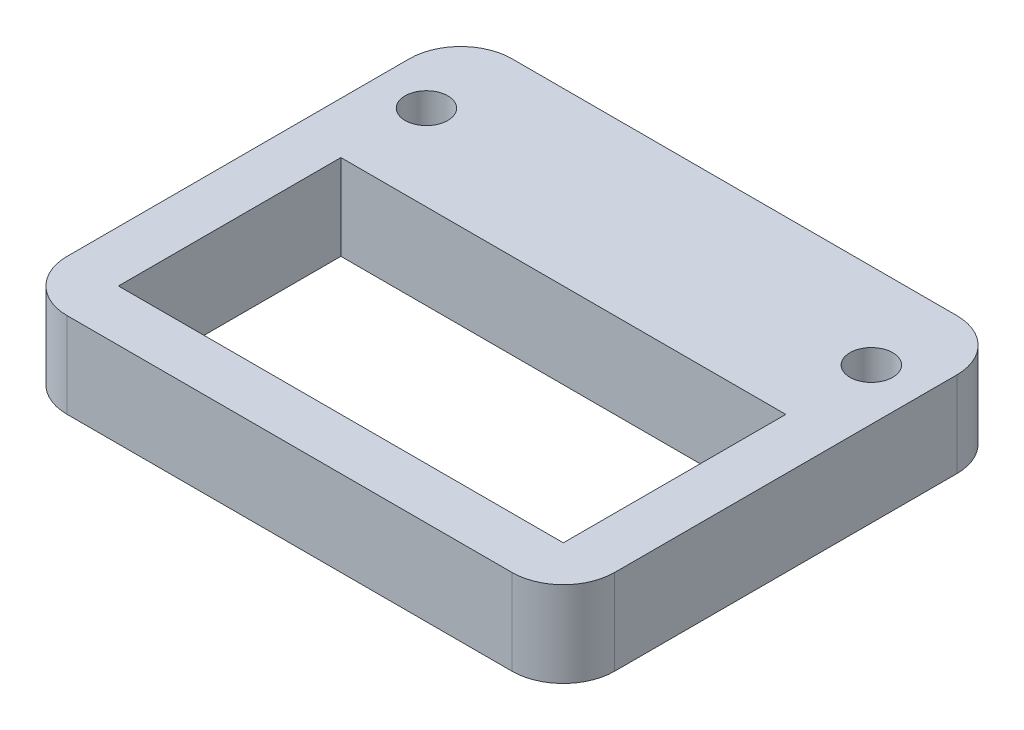
ISO-10303-21;
HEADER;
FILE_DESCRIPTION(('STEP AP214'),'2;1');
FILE_NAME('part.step','',(''),(''),'','','');
FILE_SCHEMA(('AUTOMOTIVE_DESIGN { 1 0 10303 214 1 1 1 1 }'));
ENDSEC;
DATA;
#1=APPLICATION_CONTEXT('core data for automotive mechanical design processes');
#2=APPLICATION_PROTOCOL_DEFINITION('international standard','automotive_design',2000,#1);
#3=PRODUCT_CONTEXT('',#1,'mechanical');
#4=PRODUCT('Part','Part','',(#3));
#5=PRODUCT_RELATED_PRODUCT_CATEGORY('part','',(#4));
#6=PRODUCT_DEFINITION_FORMATION('','',#4);
#7=PRODUCT_DEFINITION_CONTEXT('part definition',#1,'design');
#8=PRODUCT_DEFINITION('design','',#6,#7);
#9=PRODUCT_DEFINITION_SHAPE('','',#8);
#10=(LENGTH_UNIT() NAMED_UNIT(*) SI_UNIT(.MILLI.,.METRE.));
#11=(NAMED_UNIT(*) PLANE_ANGLE_UNIT() SI_UNIT($,.RADIAN.));
#12=(NAMED_UNIT(*) SI_UNIT($,.STERADIAN.) SOLID_ANGLE_UNIT());
#13=UNCERTAINTY_MEASURE_WITH_UNIT(LENGTH_MEASURE(1.E-05),#10,'distance_accuracy_value','');
#14=(GEOMETRIC_REPRESENTATION_CONTEXT(3) GLOBAL_UNCERTAINTY_ASSIGNED_CONTEXT((#13)) GLOBAL_UNIT_ASSIGNED_CONTEXT((#10,
#11,#12)) REPRESENTATION_CONTEXT('',''));
#15=CARTESIAN_POINT('',(0.,0.,0.));
#16=DIRECTION('',(0.,0.,1.));
#17=DIRECTION('',(1.,0.,0.));
#18=AXIS2_PLACEMENT_3D('',#15,#16,#17);
#19=CARTESIAN_POINT('',(0.,5.,0.));
#20=DIRECTION('',(0.,-1.,0.));
#21=DIRECTION('',(0.,0.,-1.));
#22=AXIS2_PLACEMENT_3D('',#19,#20,#21);
#23=PLANE('',#22);
#24=CARTESIAN_POINT('',(29.,5.,-21.));
#25=DIRECTION('',(0.,1.,0.));
#26=DIRECTION('',(0.,0.,1.));
#27=AXIS2_PLACEMENT_3D('',#24,#25,#26);
#28=CIRCLE('',#27,1.25);
#29=CARTESIAN_POINT('',(29.,5.,-19.75));
#30=VERTEX_POINT('',#29);
#31=EDGE_CURVE('E168',#30,#30,#28,.T.);
#32=ORIENTED_EDGE('',*,*,#31,.F.);
#33=EDGE_LOOP('',(#32));
#34=FACE_BOUND('',#33,.T.);
#35=DIRECTION('',(-1.,0.,0.));
#36=VECTOR('',#35,1.);
#37=CARTESIAN_POINT('',(0.,5.,-26.));
#38=LINE('',#37,#36);
#39=CARTESIAN_POINT('',(29.,5.,-26.));
#40=VERTEX_POINT('',#39);
#41=CARTESIAN_POINT('',(3.,5.,-26.));
#42=VERTEX_POINT('',#41);
#43=EDGE_CURVE('E188',#40,#42,#38,.T.);
#44=ORIENTED_EDGE('',*,*,#43,.T.);
#45=CARTESIAN_POINT('',(3.,5.,-23.));
#46=DIRECTION('',(0.,-1.,0.));
#47=DIRECTION('',(0.,0.,-1.));
#48=AXIS2_PLACEMENT_3D('',#45,#46,#47);
#49=CIRCLE('',#48,3.);
#50=CARTESIAN_POINT('',(0.,5.,-23.));
#51=VERTEX_POINT('',#50);
#52=EDGE_CURVE('E223',#42,#51,#49,.F.);
#53=ORIENTED_EDGE('',*,*,#52,.T.);
#54=DIRECTION('',(0.,0.,1.));
#55=VECTOR('',#54,1.);
#56=CARTESIAN_POINT('',(0.,5.,0.));
#57=LINE('',#56,#55);
#58=CARTESIAN_POINT('',(0.,5.,-3.));
#59=VERTEX_POINT('',#58);
#60=EDGE_CURVE('E180',#51,#59,#57,.T.);
#61=ORIENTED_EDGE('',*,*,#60,.T.);
#62=CARTESIAN_POINT('',(3.,5.,-3.));
#63=DIRECTION('',(0.,-1.,0.));
#64=DIRECTION('',(0.,0.,-1.));
#65=AXIS2_PLACEMENT_3D('',#62,#63,#64);
#66=CIRCLE('',#65,3.);
#67=CARTESIAN_POINT('',(3.,5.,0.));
#68=VERTEX_POINT('',#67);
#69=EDGE_CURVE('E219',#59,#68,#66,.F.);
#70=ORIENTED_EDGE('',*,*,#69,.T.);
#71=DIRECTION('',(1.,0.,0.));
#72=VECTOR('',#71,1.);
#73=CARTESIAN_POINT('',(0.,5.,0.));
#74=LINE('',#73,#72);
#75=CARTESIAN_POINT('',(29.,5.,0.));
#76=VERTEX_POINT('',#75);
#77=EDGE_CURVE('E183',#68,#76,#74,.T.);
#78=ORIENTED_EDGE('',*,*,#77,.T.);
#79=CARTESIAN_POINT('',(29.,5.,-3.));
#80=DIRECTION('',(0.,-1.,0.));
#81=DIRECTION('',(0.,0.,-1.));
#82=AXIS2_PLACEMENT_3D('',#79,#80,#81);
#83=CIRCLE('',#82,3.);
#84=CARTESIAN_POINT('',(32.,5.,-3.));
#85=VERTEX_POINT('',#84);
#86=EDGE_CURVE('E57',#76,#85,#83,.F.);
#87=ORIENTED_EDGE('',*,*,#86,.T.);
#88=DIRECTION('',(0.,0.,-1.));
#89=VECTOR('',#88,1.);
#90=CARTESIAN_POINT('',(32.,5.,0.));
#91=LINE('',#90,#89);
#92=CARTESIAN_POINT('',(32.,5.,-23.));
#93=VERTEX_POINT('',#92);
#94=EDGE_CURVE('E186',#85,#93,#91,.T.);
#95=ORIENTED_EDGE('',*,*,#94,.T.);
#96=CARTESIAN_POINT('',(29.,5.,-23.));
#97=DIRECTION('',(0.,-1.,0.));
#98=DIRECTION('',(0.,0.,-1.));
#99=AXIS2_PLACEMENT_3D('',#96,#97,#98);
#100=CIRCLE('',#99,3.);
#101=EDGE_CURVE('E221',#93,#40,#100,.F.);
#102=ORIENTED_EDGE('',*,*,#101,.T.);
#103=EDGE_LOOP('',(#44,#53,#61,#70,#78,#87,#95,#102));
#104=FACE_BOUND('',#103,.T.);
#105=CARTESIAN_POINT('',(3.,5.,-21.));
#106=DIRECTION('',(0.,1.,0.));
#107=DIRECTION('',(0.,0.,1.));
#108=AXIS2_PLACEMENT_3D('',#105,#106,#107);
#109=CIRCLE('',#108,1.25);
#110=CARTESIAN_POINT('',(3.,5.,-19.75));
#111=VERTEX_POINT('',#110);
#112=EDGE_CURVE('E174',#111,#111,#109,.T.);
#113=ORIENTED_EDGE('',*,*,#112,.F.);
#114=EDGE_LOOP('',(#113));
#115=FACE_BOUND('',#114,.T.);
#116=DIRECTION('',(0.,0.,1.));
#117=VECTOR('',#116,1.);
#118=CARTESIAN_POINT('',(3.,5.,-3.));
#119=LINE('',#118,#117);
#120=CARTESIAN_POINT('',(3.,5.,-16.));
#121=VERTEX_POINT('',#120);
#122=CARTESIAN_POINT('',(3.,5.,-3.));
#123=VERTEX_POINT('',#122);
#124=EDGE_CURVE('E127',#121,#123,#119,.T.);
#125=ORIENTED_EDGE('',*,*,#124,.F.);
#126=DIRECTION('',(-1.,0.,0.));
#127=VECTOR('',#126,1.);
#128=CARTESIAN_POINT('',(3.,5.,-16.));
#129=LINE('',#128,#127);
#130=CARTESIAN_POINT('',(29.,5.,-16.));
#131=VERTEX_POINT('',#130);
#132=EDGE_CURVE('E152',#131,#121,#129,.T.);
#133=ORIENTED_EDGE('',*,*,#132,.F.);
#134=DIRECTION('',(0.,0.,-1.));
#135=VECTOR('',#134,1.);
#136=CARTESIAN_POINT('',(29.,5.,-3.));
#137=LINE('',#136,#135);
#138=CARTESIAN_POINT('',(29.,5.,-3.));
#139=VERTEX_POINT('',#138);
#140=EDGE_CURVE('E150',#139,#131,#137,.T.);
#141=ORIENTED_EDGE('',*,*,#140,.F.);
#142=DIRECTION('',(1.,0.,0.));
#143=VECTOR('',#142,1.);
#144=CARTESIAN_POINT('',(3.,5.,-3.));
#145=LINE('',#144,#143);
#146=EDGE_CURVE('E137',#123,#139,#145,.T.);
#147=ORIENTED_EDGE('',*,*,#146,.F.);
#148=EDGE_LOOP('',(#125,#133,#141,#147));
#149=FACE_BOUND('',#148,.T.);
#150=ADVANCED_FACE('F35',(#34,#104,#115,#149),#23,.F.);
#151=CARTESIAN_POINT('',(0.,0.,0.));
#152=DIRECTION('',(0.,-1.,0.));
#153=DIRECTION('',(0.,0.,-1.));
#154=AXIS2_PLACEMENT_3D('',#151,#152,#153);
#155=PLANE('',#154);
#156=CARTESIAN_POINT('',(29.,0.,-21.));
#157=DIRECTION('',(0.,1.,0.));
#158=DIRECTION('',(0.,0.,1.));
#159=AXIS2_PLACEMENT_3D('',#156,#157,#158);
#160=CIRCLE('',#159,1.25);
#161=CARTESIAN_POINT('',(29.,0.,-19.75));
#162=VERTEX_POINT('',#161);
#163=EDGE_CURVE('E145',#162,#162,#160,.T.);
#164=ORIENTED_EDGE('',*,*,#163,.T.);
#165=EDGE_LOOP('',(#164));
#166=FACE_BOUND('',#165,.T.);
#167=DIRECTION('',(0.,0.,1.));
#168=VECTOR('',#167,1.);
#169=CARTESIAN_POINT('',(0.,0.,0.));
#170=LINE('',#169,#168);
#171=CARTESIAN_POINT('',(0.,0.,-23.));
#172=VERTEX_POINT('',#171);
#173=CARTESIAN_POINT('',(0.,0.,-3.));
#174=VERTEX_POINT('',#173);
#175=EDGE_CURVE('E177',#172,#174,#170,.T.);
#176=ORIENTED_EDGE('',*,*,#175,.F.);
#177=CARTESIAN_POINT('',(3.,0.,-23.));
#178=DIRECTION('',(0.,-1.,0.));
#179=DIRECTION('',(0.,0.,-1.));
#180=AXIS2_PLACEMENT_3D('',#177,#178,#179);
#181=CIRCLE('',#180,3.);
#182=CARTESIAN_POINT('',(3.,0.,-26.));
#183=VERTEX_POINT('',#182);
#184=EDGE_CURVE('E211',#172,#183,#181,.T.);
#185=ORIENTED_EDGE('',*,*,#184,.T.);
#186=DIRECTION('',(-1.,0.,0.));
#187=VECTOR('',#186,1.);
#188=CARTESIAN_POINT('',(0.,0.,-26.));
#189=LINE('',#188,#187);
#190=CARTESIAN_POINT('',(29.,0.,-26.));
#191=VERTEX_POINT('',#190);
#192=EDGE_CURVE('E184',#191,#183,#189,.T.);
#193=ORIENTED_EDGE('',*,*,#192,.F.);
#194=CARTESIAN_POINT('',(29.,0.,-23.));
#195=DIRECTION('',(0.,-1.,0.));
#196=DIRECTION('',(0.,0.,-1.));
#197=AXIS2_PLACEMENT_3D('',#194,#195,#196);
#198=CIRCLE('',#197,3.);
#199=CARTESIAN_POINT('',(32.,0.,-23.));
#200=VERTEX_POINT('',#199);
#201=EDGE_CURVE('E209',#191,#200,#198,.T.);
#202=ORIENTED_EDGE('',*,*,#201,.T.);
#203=DIRECTION('',(0.,0.,-1.));
#204=VECTOR('',#203,1.);
#205=CARTESIAN_POINT('',(32.,0.,0.));
#206=LINE('',#205,#204);
#207=CARTESIAN_POINT('',(32.,0.,-3.));
#208=VERTEX_POINT('',#207);
#209=EDGE_CURVE('E197',#208,#200,#206,.T.);
#210=ORIENTED_EDGE('',*,*,#209,.F.);
#211=CARTESIAN_POINT('',(29.,0.,-3.));
#212=DIRECTION('',(0.,-1.,0.));
#213=DIRECTION('',(0.,0.,-1.));
#214=AXIS2_PLACEMENT_3D('',#211,#212,#213);
#215=CIRCLE('',#214,3.);
#216=CARTESIAN_POINT('',(29.,0.,0.));
#217=VERTEX_POINT('',#216);
#218=EDGE_CURVE('E205',#208,#217,#215,.T.);
#219=ORIENTED_EDGE('',*,*,#218,.T.);
#220=DIRECTION('',(1.,0.,0.));
#221=VECTOR('',#220,1.);
#222=CARTESIAN_POINT('',(0.,0.,0.));
#223=LINE('',#222,#221);
#224=CARTESIAN_POINT('',(3.,0.,0.));
#225=VERTEX_POINT('',#224);
#226=EDGE_CURVE('E194',#225,#217,#223,.T.);
#227=ORIENTED_EDGE('',*,*,#226,.F.);
#228=CARTESIAN_POINT('',(3.,0.,-3.));
#229=DIRECTION('',(0.,-1.,0.));
#230=DIRECTION('',(0.,0.,-1.));
#231=AXIS2_PLACEMENT_3D('',#228,#229,#230);
#232=CIRCLE('',#231,3.);
#233=EDGE_CURVE('E207',#225,#174,#232,.T.);
#234=ORIENTED_EDGE('',*,*,#233,.T.);
#235=EDGE_LOOP('',(#176,#185,#193,#202,#210,#219,#227,#234));
#236=FACE_BOUND('',#235,.T.);
#237=CARTESIAN_POINT('',(3.,0.,-21.));
#238=DIRECTION('',(0.,1.,0.));
#239=DIRECTION('',(0.,0.,1.));
#240=AXIS2_PLACEMENT_3D('',#237,#238,#239);
#241=CIRCLE('',#240,1.25);
#242=CARTESIAN_POINT('',(3.,0.,-19.75));
#243=VERTEX_POINT('',#242);
#244=EDGE_CURVE('E171',#243,#243,#241,.T.);
#245=ORIENTED_EDGE('',*,*,#244,.T.);
#246=EDGE_LOOP('',(#245));
#247=FACE_BOUND('',#246,.T.);
#248=DIRECTION('',(-1.,0.,0.));
#249=VECTOR('',#248,1.);
#250=CARTESIAN_POINT('',(3.,0.,-16.));
#251=LINE('',#250,#249);
#252=CARTESIAN_POINT('',(29.,0.,-16.));
#253=VERTEX_POINT('',#252);
#254=CARTESIAN_POINT('',(3.,0.,-16.));
#255=VERTEX_POINT('',#254);
#256=EDGE_CURVE('E138',#253,#255,#251,.T.);
#257=ORIENTED_EDGE('',*,*,#256,.T.);
#258=DIRECTION('',(0.,0.,1.));
#259=VECTOR('',#258,1.);
#260=CARTESIAN_POINT('',(3.,0.,-3.));
#261=LINE('',#260,#259);
#262=CARTESIAN_POINT('',(3.,0.,-3.));
#263=VERTEX_POINT('',#262);
#264=EDGE_CURVE('E156',#255,#263,#261,.T.);
#265=ORIENTED_EDGE('',*,*,#264,.T.);
#266=DIRECTION('',(1.,0.,0.));
#267=VECTOR('',#266,1.);
#268=CARTESIAN_POINT('',(3.,0.,-3.));
#269=LINE('',#268,#267);
#270=CARTESIAN_POINT('',(29.,0.,-3.));
#271=VERTEX_POINT('',#270);
#272=EDGE_CURVE('E144',#263,#271,#269,.T.);
#273=ORIENTED_EDGE('',*,*,#272,.T.);
#274=DIRECTION('',(0.,0.,-1.));
#275=VECTOR('',#274,1.);
#276=CARTESIAN_POINT('',(29.,0.,-3.));
#277=LINE('',#276,#275);
#278=EDGE_CURVE('E159',#271,#253,#277,.T.);
#279=ORIENTED_EDGE('',*,*,#278,.T.);
#280=EDGE_LOOP('',(#257,#265,#273,#279));
#281=FACE_BOUND('',#280,.T.);
#282=ADVANCED_FACE('F242',(#166,#236,#247,#281),#155,.T.);
#283=CARTESIAN_POINT('',(0.,5.,0.));
#284=DIRECTION('',(1.,0.,0.));
#285=DIRECTION('',(0.,0.,-1.));
#286=AXIS2_PLACEMENT_3D('',#283,#284,#285);
#287=PLANE('',#286);
#288=ORIENTED_EDGE('',*,*,#60,.F.);
#289=DIRECTION('',(0.,-1.,0.));
#290=VECTOR('',#289,1.);
#291=CARTESIAN_POINT('',(0.,5.,-23.));
#292=LINE('',#291,#290);
#293=EDGE_CURVE('E202',#51,#172,#292,.T.);
#294=ORIENTED_EDGE('',*,*,#293,.T.);
#295=ORIENTED_EDGE('',*,*,#175,.T.);
#296=DIRECTION('',(0.,-1.,0.));
#297=VECTOR('',#296,1.);
#298=CARTESIAN_POINT('',(0.,5.,-3.));
#299=LINE('',#298,#297);
#300=EDGE_CURVE('E191',#174,#59,#299,.F.);
#301=ORIENTED_EDGE('',*,*,#300,.T.);
#302=EDGE_LOOP('',(#288,#294,#295,#301));
#303=FACE_BOUND('',#302,.T.);
#304=ADVANCED_FACE('F259',(#303),#287,.F.);
#305=CARTESIAN_POINT('',(0.,5.,0.));
#306=DIRECTION('',(0.,0.,-1.));
#307=DIRECTION('',(-1.,0.,0.));
#308=AXIS2_PLACEMENT_3D('',#305,#306,#307);
#309=PLANE('',#308);
#310=ORIENTED_EDGE('',*,*,#77,.F.);
#311=DIRECTION('',(0.,-1.,0.));
#312=VECTOR('',#311,1.);
#313=CARTESIAN_POINT('',(3.,5.,0.));
#314=LINE('',#313,#312);
#315=EDGE_CURVE('E11',#68,#225,#314,.T.);
#316=ORIENTED_EDGE('',*,*,#315,.T.);
#317=ORIENTED_EDGE('',*,*,#226,.T.);
#318=DIRECTION('',(0.,-1.,0.));
#319=VECTOR('',#318,1.);
#320=CARTESIAN_POINT('',(29.,5.,0.));
#321=LINE('',#320,#319);
#322=EDGE_CURVE('E43',#217,#76,#321,.F.);
#323=ORIENTED_EDGE('',*,*,#322,.T.);
#324=EDGE_LOOP('',(#310,#316,#317,#323));
#325=FACE_BOUND('',#324,.T.);
#326=ADVANCED_FACE('F231',(#325),#309,.F.);
#327=CARTESIAN_POINT('',(32.,5.,0.));
#328=DIRECTION('',(-1.,0.,0.));
#329=DIRECTION('',(0.,0.,1.));
#330=AXIS2_PLACEMENT_3D('',#327,#328,#329);
#331=PLANE('',#330);
#332=ORIENTED_EDGE('',*,*,#209,.T.);
#333=DIRECTION('',(0.,-1.,0.));
#334=VECTOR('',#333,1.);
#335=CARTESIAN_POINT('',(32.,5.,-23.));
#336=LINE('',#335,#334);
#337=EDGE_CURVE('E50',#200,#93,#336,.F.);
#338=ORIENTED_EDGE('',*,*,#337,.T.);
#339=ORIENTED_EDGE('',*,*,#94,.F.);
#340=DIRECTION('',(0.,-1.,0.));
#341=VECTOR('',#340,1.);
#342=CARTESIAN_POINT('',(32.,5.,-3.));
#343=LINE('',#342,#341);
#344=EDGE_CURVE('E225',#85,#208,#343,.T.);
#345=ORIENTED_EDGE('',*,*,#344,.T.);
#346=EDGE_LOOP('',(#332,#338,#339,#345));
#347=FACE_BOUND('',#346,.T.);
#348=ADVANCED_FACE('F239',(#347),#331,.F.);
#349=CARTESIAN_POINT('',(0.,5.,-26.));
#350=DIRECTION('',(0.,0.,1.));
#351=DIRECTION('',(1.,0.,0.));
#352=AXIS2_PLACEMENT_3D('',#349,#350,#351);
#353=PLANE('',#352);
#354=ORIENTED_EDGE('',*,*,#192,.T.);
#355=DIRECTION('',(0.,-1.,0.));
#356=VECTOR('',#355,1.);
#357=CARTESIAN_POINT('',(3.,5.,-26.));
#358=LINE('',#357,#356);
#359=EDGE_CURVE('E216',#183,#42,#358,.F.);
#360=ORIENTED_EDGE('',*,*,#359,.T.);
#361=ORIENTED_EDGE('',*,*,#43,.F.);
#362=DIRECTION('',(0.,-1.,0.));
#363=VECTOR('',#362,1.);
#364=CARTESIAN_POINT('',(29.,5.,-26.));
#365=LINE('',#364,#363);
#366=EDGE_CURVE('E213',#40,#191,#365,.T.);
#367=ORIENTED_EDGE('',*,*,#366,.T.);
#368=EDGE_LOOP('',(#354,#360,#361,#367));
#369=FACE_BOUND('',#368,.T.);
#370=ADVANCED_FACE('F251',(#369),#353,.F.);
#371=CARTESIAN_POINT('',(3.,5.,-21.));
#372=DIRECTION('',(0.,-1.,0.));
#373=DIRECTION('',(0.,0.,-1.));
#374=AXIS2_PLACEMENT_3D('',#371,#372,#373);
#375=CYLINDRICAL_SURFACE('',#374,1.25);
#376=ORIENTED_EDGE('',*,*,#112,.T.);
#377=EDGE_LOOP('',(#376));
#378=FACE_BOUND('',#377,.T.);
#379=ORIENTED_EDGE('',*,*,#244,.F.);
#380=EDGE_LOOP('',(#379));
#381=FACE_BOUND('',#380,.T.);
#382=ADVANCED_FACE('F279',(#378,#381),#375,.F.);
#383=CARTESIAN_POINT('',(29.,5.,-21.));
#384=DIRECTION('',(0.,-1.,0.));
#385=DIRECTION('',(0.,0.,-1.));
#386=AXIS2_PLACEMENT_3D('',#383,#384,#385);
#387=CYLINDRICAL_SURFACE('',#386,1.25);
#388=ORIENTED_EDGE('',*,*,#31,.T.);
#389=EDGE_LOOP('',(#388));
#390=FACE_BOUND('',#389,.T.);
#391=ORIENTED_EDGE('',*,*,#163,.F.);
#392=EDGE_LOOP('',(#391));
#393=FACE_BOUND('',#392,.T.);
#394=ADVANCED_FACE('F308',(#390,#393),#387,.F.);
#395=CARTESIAN_POINT('',(3.,5.,-3.));
#396=DIRECTION('',(1.,0.,0.));
#397=DIRECTION('',(0.,0.,-1.));
#398=AXIS2_PLACEMENT_3D('',#395,#396,#397);
#399=PLANE('',#398);
#400=ORIENTED_EDGE('',*,*,#264,.F.);
#401=DIRECTION('',(0.,-1.,0.));
#402=VECTOR('',#401,1.);
#403=CARTESIAN_POINT('',(3.,5.,-16.));
#404=LINE('',#403,#402);
#405=EDGE_CURVE('E133',#121,#255,#404,.T.);
#406=ORIENTED_EDGE('',*,*,#405,.F.);
#407=ORIENTED_EDGE('',*,*,#124,.T.);
#408=DIRECTION('',(0.,-1.,0.));
#409=VECTOR('',#408,1.);
#410=CARTESIAN_POINT('',(3.,5.,-3.));
#411=LINE('',#410,#409);
#412=EDGE_CURVE('E130',#123,#263,#411,.T.);
#413=ORIENTED_EDGE('',*,*,#412,.T.);
#414=EDGE_LOOP('',(#400,#406,#407,#413));
#415=FACE_BOUND('',#414,.T.);
#416=ADVANCED_FACE('F129',(#415),#399,.T.);
#417=CARTESIAN_POINT('',(3.,5.,-3.));
#418=DIRECTION('',(0.,0.,-1.));
#419=DIRECTION('',(-1.,0.,0.));
#420=AXIS2_PLACEMENT_3D('',#417,#418,#419);
#421=PLANE('',#420);
#422=ORIENTED_EDGE('',*,*,#272,.F.);
#423=ORIENTED_EDGE('',*,*,#412,.F.);
#424=ORIENTED_EDGE('',*,*,#146,.T.);
#425=DIRECTION('',(0.,-1.,0.));
#426=VECTOR('',#425,1.);
#427=CARTESIAN_POINT('',(29.,5.,-3.));
#428=LINE('',#427,#426);
#429=EDGE_CURVE('E146',#139,#271,#428,.T.);
#430=ORIENTED_EDGE('',*,*,#429,.T.);
#431=EDGE_LOOP('',(#422,#423,#424,#430));
#432=FACE_BOUND('',#431,.T.);
#433=ADVANCED_FACE('F141',(#432),#421,.T.);
#434=CARTESIAN_POINT('',(29.,5.,-3.));
#435=DIRECTION('',(-1.,0.,0.));
#436=DIRECTION('',(0.,0.,1.));
#437=AXIS2_PLACEMENT_3D('',#434,#435,#436);
#438=PLANE('',#437);
#439=ORIENTED_EDGE('',*,*,#278,.F.);
#440=ORIENTED_EDGE('',*,*,#429,.F.);
#441=ORIENTED_EDGE('',*,*,#140,.T.);
#442=DIRECTION('',(0.,-1.,0.));
#443=VECTOR('',#442,1.);
#444=CARTESIAN_POINT('',(29.,5.,-16.));
#445=LINE('',#444,#443);
#446=EDGE_CURVE('E165',#131,#253,#445,.T.);
#447=ORIENTED_EDGE('',*,*,#446,.T.);
#448=EDGE_LOOP('',(#439,#440,#441,#447));
#449=FACE_BOUND('',#448,.T.);
#450=ADVANCED_FACE('F295',(#449),#438,.T.);
#451=CARTESIAN_POINT('',(3.,5.,-16.));
#452=DIRECTION('',(0.,0.,1.));
#453=DIRECTION('',(1.,0.,0.));
#454=AXIS2_PLACEMENT_3D('',#451,#452,#453);
#455=PLANE('',#454);
#456=ORIENTED_EDGE('',*,*,#256,.F.);
#457=ORIENTED_EDGE('',*,*,#446,.F.);
#458=ORIENTED_EDGE('',*,*,#132,.T.);
#459=ORIENTED_EDGE('',*,*,#405,.T.);
#460=EDGE_LOOP('',(#456,#457,#458,#459));
#461=FACE_BOUND('',#460,.T.);
#462=ADVANCED_FACE('F291',(#461),#455,.T.);
#463=CARTESIAN_POINT('',(3.,5.,-23.));
#464=DIRECTION('',(0.,-1.,0.));
#465=DIRECTION('',(0.,0.,-1.));
#466=AXIS2_PLACEMENT_3D('',#463,#464,#465);
#467=CYLINDRICAL_SURFACE('',#466,3.);
#468=ORIENTED_EDGE('',*,*,#52,.F.);
#469=ORIENTED_EDGE('',*,*,#359,.F.);
#470=ORIENTED_EDGE('',*,*,#184,.F.);
#471=ORIENTED_EDGE('',*,*,#293,.F.);
#472=EDGE_LOOP('',(#468,#469,#470,#471));
#473=FACE_BOUND('',#472,.T.);
#474=ADVANCED_FACE('F257',(#473),#467,.T.);
#475=CARTESIAN_POINT('',(29.,5.,-23.));
#476=DIRECTION('',(0.,-1.,0.));
#477=DIRECTION('',(0.,0.,-1.));
#478=AXIS2_PLACEMENT_3D('',#475,#476,#477);
#479=CYLINDRICAL_SURFACE('',#478,3.);
#480=ORIENTED_EDGE('',*,*,#101,.F.);
#481=ORIENTED_EDGE('',*,*,#337,.F.);
#482=ORIENTED_EDGE('',*,*,#201,.F.);
#483=ORIENTED_EDGE('',*,*,#366,.F.);
#484=EDGE_LOOP('',(#480,#481,#482,#483));
#485=FACE_BOUND('',#484,.T.);
#486=ADVANCED_FACE('F248',(#485),#479,.T.);
#487=CARTESIAN_POINT('',(3.,5.,-3.));
#488=DIRECTION('',(0.,-1.,0.));
#489=DIRECTION('',(0.,0.,-1.));
#490=AXIS2_PLACEMENT_3D('',#487,#488,#489);
#491=CYLINDRICAL_SURFACE('',#490,3.);
#492=ORIENTED_EDGE('',*,*,#69,.F.);
#493=ORIENTED_EDGE('',*,*,#300,.F.);
#494=ORIENTED_EDGE('',*,*,#233,.F.);
#495=ORIENTED_EDGE('',*,*,#315,.F.);
#496=EDGE_LOOP('',(#492,#493,#494,#495));
#497=FACE_BOUND('',#496,.T.);
#498=ADVANCED_FACE('F262',(#497),#491,.T.);
#499=CARTESIAN_POINT('',(29.,5.,-3.));
#500=DIRECTION('',(0.,-1.,0.));
#501=DIRECTION('',(0.,0.,-1.));
#502=AXIS2_PLACEMENT_3D('',#499,#500,#501);
#503=CYLINDRICAL_SURFACE('',#502,3.);
#504=ORIENTED_EDGE('',*,*,#86,.F.);
#505=ORIENTED_EDGE('',*,*,#322,.F.);
#506=ORIENTED_EDGE('',*,*,#218,.F.);
#507=ORIENTED_EDGE('',*,*,#344,.F.);
#508=EDGE_LOOP('',(#504,#505,#506,#507));
#509=FACE_BOUND('',#508,.T.);
#510=ADVANCED_FACE('F37',(#509),#503,.T.);
#511=CLOSED_SHELL('',(#150,#282,#304,#326,#348,#370,#382,#394,#416,#433,#450,#462,#474,#486,
#498,#510));
#512=MANIFOLD_SOLID_BREP('B2',#511);
#513=ADVANCED_BREP_SHAPE_REPRESENTATION('',(#18,#512),#14);
#514=SHAPE_DEFINITION_REPRESENTATION(#9,#513);
ENDSEC;
END-ISO-10303-21;
